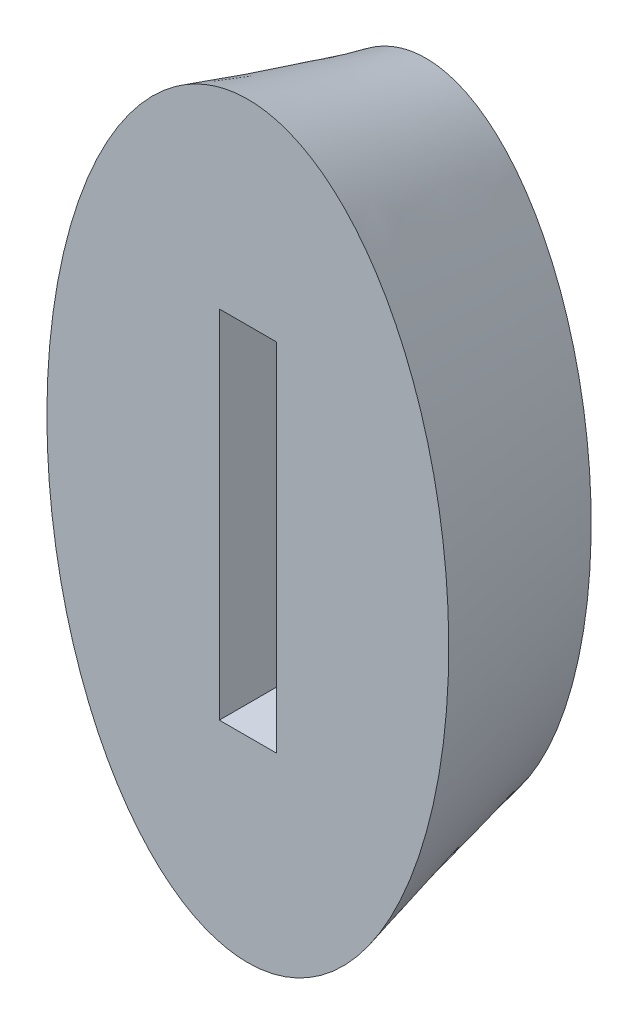
ISO-10303-21;
HEADER;
FILE_DESCRIPTION(('STEP AP214'),'2;1');
FILE_NAME('part.step','',(''),(''),'','','');
FILE_SCHEMA(('AUTOMOTIVE_DESIGN { 1 0 10303 214 1 1 1 1 }'));
ENDSEC;
DATA;
#1=APPLICATION_CONTEXT('core data for automotive mechanical design processes');
#2=APPLICATION_PROTOCOL_DEFINITION('international standard','automotive_design',2000,#1);
#3=PRODUCT_CONTEXT('',#1,'mechanical');
#4=PRODUCT('Part','Part','',(#3));
#5=PRODUCT_RELATED_PRODUCT_CATEGORY('part','',(#4));
#6=PRODUCT_DEFINITION_FORMATION('','',#4);
#7=PRODUCT_DEFINITION_CONTEXT('part definition',#1,'design');
#8=PRODUCT_DEFINITION('design','',#6,#7);
#9=PRODUCT_DEFINITION_SHAPE('','',#8);
#10=(LENGTH_UNIT() NAMED_UNIT(*) SI_UNIT(.MILLI.,.METRE.));
#11=(NAMED_UNIT(*) PLANE_ANGLE_UNIT() SI_UNIT($,.RADIAN.));
#12=(NAMED_UNIT(*) SI_UNIT($,.STERADIAN.) SOLID_ANGLE_UNIT());
#13=UNCERTAINTY_MEASURE_WITH_UNIT(LENGTH_MEASURE(1.E-05),#10,'distance_accuracy_value','');
#14=(GEOMETRIC_REPRESENTATION_CONTEXT(3) GLOBAL_UNCERTAINTY_ASSIGNED_CONTEXT((#13)) GLOBAL_UNIT_ASSIGNED_CONTEXT((#10,
#11,#12)) REPRESENTATION_CONTEXT('',''));
#15=CARTESIAN_POINT('',(0.,0.,0.));
#16=DIRECTION('',(0.,0.,1.));
#17=DIRECTION('',(1.,0.,0.));
#18=AXIS2_PLACEMENT_3D('',#15,#16,#17);
#19=CARTESIAN_POINT('',(0.,0.,-12.5));
#20=DIRECTION('',(0.,0.,1.));
#21=DIRECTION('',(1.,0.,0.));
#22=AXIS2_PLACEMENT_3D('',#19,#20,#21);
#23=PLANE('',#22);
#24=DIRECTION('',(1.,0.,0.));
#25=VECTOR('',#24,1.);
#26=CARTESIAN_POINT('',(0.,-12.5,-12.5));
#27=LINE('',#26,#25);
#28=CARTESIAN_POINT('',(-2.,-12.5,-12.5));
#29=VERTEX_POINT('',#28);
#30=CARTESIAN_POINT('',(2.,-12.5,-12.5));
#31=VERTEX_POINT('',#30);
#32=EDGE_CURVE('E263',#29,#31,#27,.T.);
#33=ORIENTED_EDGE('',*,*,#32,.T.);
#34=DIRECTION('',(0.,1.,0.));
#35=VECTOR('',#34,1.);
#36=CARTESIAN_POINT('',(2.,0.,-12.5));
#37=LINE('',#36,#35);
#38=CARTESIAN_POINT('',(2.,12.5,-12.5));
#39=VERTEX_POINT('',#38);
#40=EDGE_CURVE('E226',#31,#39,#37,.T.);
#41=ORIENTED_EDGE('',*,*,#40,.T.);
#42=DIRECTION('',(-1.,0.,0.));
#43=VECTOR('',#42,1.);
#44=CARTESIAN_POINT('',(0.,12.5,-12.5));
#45=LINE('',#44,#43);
#46=CARTESIAN_POINT('',(-2.,12.5,-12.5));
#47=VERTEX_POINT('',#46);
#48=EDGE_CURVE('E271',#39,#47,#45,.T.);
#49=ORIENTED_EDGE('',*,*,#48,.T.);
#50=DIRECTION('',(0.,-1.,0.));
#51=VECTOR('',#50,1.);
#52=CARTESIAN_POINT('',(-2.,0.,-12.5));
#53=LINE('',#52,#51);
#54=EDGE_CURVE('E267',#47,#29,#53,.T.);
#55=ORIENTED_EDGE('',*,*,#54,.T.);
#56=EDGE_LOOP('',(#33,#41,#49,#55));
#57=FACE_BOUND('',#56,.T.);
#58=DIRECTION('',(0.,1.,0.));
#59=VECTOR('',#58,1.);
#60=CARTESIAN_POINT('',(-4.00911681817695,15.0341819392631,-12.5));
#61=LINE('',#60,#59);
#62=CARTESIAN_POINT('',(-4.00911681817695,-15.0341819392631,-12.5));
#63=VERTEX_POINT('',#62);
#64=CARTESIAN_POINT('',(-4.00911681817695,15.0341819392631,-12.5));
#65=VERTEX_POINT('',#64);
#66=EDGE_CURVE('E160',#63,#65,#61,.T.);
#67=ORIENTED_EDGE('',*,*,#66,.T.);
#68=DIRECTION('',(1.,0.,0.));
#69=VECTOR('',#68,1.);
#70=CARTESIAN_POINT('',(4.00911681817695,15.0341819392631,-12.5));
#71=LINE('',#70,#69);
#72=CARTESIAN_POINT('',(4.00911681817695,15.0341819392631,-12.5));
#73=VERTEX_POINT('',#72);
#74=EDGE_CURVE('E127',#65,#73,#71,.T.);
#75=ORIENTED_EDGE('',*,*,#74,.T.);
#76=DIRECTION('',(0.,-1.,0.));
#77=VECTOR('',#76,1.);
#78=CARTESIAN_POINT('',(4.00911681817695,15.0341819392631,-12.5));
#79=LINE('',#78,#77);
#80=CARTESIAN_POINT('',(4.00911681817695,-15.0341819392631,-12.5));
#81=VERTEX_POINT('',#80);
#82=EDGE_CURVE('E71',#73,#81,#79,.T.);
#83=ORIENTED_EDGE('',*,*,#82,.T.);
#84=DIRECTION('',(-1.,0.,0.));
#85=VECTOR('',#84,1.);
#86=CARTESIAN_POINT('',(4.00911681817695,-15.0341819392631,-12.5));
#87=LINE('',#86,#85);
#88=EDGE_CURVE('E150',#81,#63,#87,.T.);
#89=ORIENTED_EDGE('',*,*,#88,.T.);
#90=EDGE_LOOP('',(#67,#75,#83,#89));
#91=FACE_BOUND('',#90,.T.);
#92=ADVANCED_FACE('F53',(#57,#91),#23,.F.);
#93=CARTESIAN_POINT('',(0.,0.,-12.5));
#94=DIRECTION('',(0.,0.,-1.));
#95=DIRECTION('',(0.,-1.,0.));
#96=AXIS2_PLACEMENT_3D('',#93,#94,#95);
#97=ELLIPSE('',#96,19.3105732119852,9.88915481816979);
#98=CARTESIAN_POINT('',(0.,-19.3105732119852,-12.5));
#99=VERTEX_POINT('',#98);
#100=EDGE_CURVE('E169',#99,#99,#97,.T.);
#101=ORIENTED_EDGE('',*,*,#100,.F.);
#102=EDGE_LOOP('',(#101));
#103=FACE_BOUND('',#102,.T.);
#104=CARTESIAN_POINT('',(0.,0.,-12.5));
#105=DIRECTION('',(0.,0.,1.));
#106=DIRECTION('',(0.,-1.,0.));
#107=AXIS2_PLACEMENT_3D('',#104,#105,#106);
#108=ELLIPSE('',#107,22.5,11.606);
#109=CARTESIAN_POINT('',(0.,-22.5,-12.5));
#110=VERTEX_POINT('',#109);
#111=EDGE_CURVE('E12',#110,#110,#108,.T.);
#112=ORIENTED_EDGE('',*,*,#111,.F.);
#113=EDGE_LOOP('',(#112));
#114=FACE_BOUND('',#113,.T.);
#115=ADVANCED_FACE('F55',(#103,#114),#23,.F.);
#116=CARTESIAN_POINT('',(0.,0.,0.));
#117=DIRECTION('',(0.,0.,1.));
#118=DIRECTION('',(1.,0.,0.));
#119=AXIS2_PLACEMENT_3D('',#116,#117,#118);
#120=PLANE('',#119);
#121=DIRECTION('',(0.,1.,0.));
#122=VECTOR('',#121,1.);
#123=CARTESIAN_POINT('',(2.,12.5,0.));
#124=LINE('',#123,#122);
#125=CARTESIAN_POINT('',(2.,-12.5,0.));
#126=VERTEX_POINT('',#125);
#127=CARTESIAN_POINT('',(2.,12.5,0.));
#128=VERTEX_POINT('',#127);
#129=EDGE_CURVE('E180',#126,#128,#124,.T.);
#130=ORIENTED_EDGE('',*,*,#129,.F.);
#131=DIRECTION('',(1.,0.,0.));
#132=VECTOR('',#131,1.);
#133=CARTESIAN_POINT('',(-2.,-12.5,0.));
#134=LINE('',#133,#132);
#135=CARTESIAN_POINT('',(-2.,-12.5,0.));
#136=VERTEX_POINT('',#135);
#137=EDGE_CURVE('E280',#136,#126,#134,.T.);
#138=ORIENTED_EDGE('',*,*,#137,.F.);
#139=DIRECTION('',(0.,-1.,0.));
#140=VECTOR('',#139,1.);
#141=CARTESIAN_POINT('',(-2.,12.5,0.));
#142=LINE('',#141,#140);
#143=CARTESIAN_POINT('',(-2.,12.5,0.));
#144=VERTEX_POINT('',#143);
#145=EDGE_CURVE('E291',#144,#136,#142,.T.);
#146=ORIENTED_EDGE('',*,*,#145,.F.);
#147=DIRECTION('',(-1.,0.,0.));
#148=VECTOR('',#147,1.);
#149=CARTESIAN_POINT('',(-2.,12.5,0.));
#150=LINE('',#149,#148);
#151=EDGE_CURVE('E295',#128,#144,#150,.T.);
#152=ORIENTED_EDGE('',*,*,#151,.F.);
#153=EDGE_LOOP('',(#130,#138,#146,#152));
#154=FACE_BOUND('',#153,.T.);
#155=CARTESIAN_POINT('',(0.,0.,0.));
#156=DIRECTION('',(0.,0.,1.));
#157=DIRECTION('',(0.,-1.,0.));
#158=AXIS2_PLACEMENT_3D('',#155,#156,#157);
#159=ELLIPSE('',#158,26.25,14.106);
#160=CARTESIAN_POINT('',(0.,-26.25,0.));
#161=VERTEX_POINT('',#160);
#162=EDGE_CURVE('E64',#161,#161,#159,.T.);
#163=ORIENTED_EDGE('',*,*,#162,.T.);
#164=EDGE_LOOP('',(#163));
#165=FACE_BOUND('',#164,.T.);
#166=ADVANCED_FACE('F205',(#154,#165),#120,.T.);
#167=CARTESIAN_POINT('',(13.179644062293,9.35581181622284,0.));
#168=CARTESIAN_POINT('',(9.96742864078532,11.5263610145073,-12.5));
#169=CARTESIAN_POINT('',(23.2347359845512,-39.6964576627493,0.));
#170=CARTESIAN_POINT('',(21.8585349460628,-27.120398319918,-12.5));
#171=CARTESIAN_POINT('',(-3.12455214003473,-58.408081295195,0.));
#172=CARTESIAN_POINT('',(1.92367766449215,-50.1731203489325,-12.5));
#173=CARTESIAN_POINT('',(-13.179644062293,-9.35581181622284,0.));
#174=CARTESIAN_POINT('',(-9.96742864078532,-11.5263610145073,-12.5));
#175=CARTESIAN_POINT('',(-23.2347359845512,39.6964576627493,0.));
#176=CARTESIAN_POINT('',(-21.8585349460628,27.1203983199179,-12.5));
#177=CARTESIAN_POINT('',(3.12455214003474,58.408081295195,0.));
#178=CARTESIAN_POINT('',(-1.92367766449216,50.1731203489325,-12.5));
#179=CARTESIAN_POINT('',(13.179644062293,9.35581181622284,0.));
#180=CARTESIAN_POINT('',(9.96742864078532,11.5263610145073,-12.5));
#181=(BOUNDED_SURFACE() B_SPLINE_SURFACE(3,1,((#167,#168),(#169,#170),(#171,#172),(#173,#174),
(#175,#176),(#177,#178),(#179,#180)),.UNSPECIFIED.,.T.,.F.,.F.) B_SPLINE_SURFACE_WITH_KNOTS((4,
3,4),(2,2),(0.,0.5,1.),(0.,1.),
.UNSPECIFIED.) GEOMETRIC_REPRESENTATION_ITEM() RATIONAL_B_SPLINE_SURFACE(((1.,1.),
(0.333333333333333,0.333333333333333),(0.333333333333333,0.333333333333333),(1.,1.),
(0.333333333333333,0.333333333333334),(0.333333333333333,0.333333333333334),(1.,1.))) REPRESENTATION_ITEM('') SURFACE());
#182=ORIENTED_EDGE('',*,*,#162,.F.);
#183=EDGE_LOOP('',(#182));
#184=FACE_BOUND('',#183,.T.);
#185=ORIENTED_EDGE('',*,*,#111,.T.);
#186=EDGE_LOOP('',(#185));
#187=FACE_BOUND('',#186,.T.);
#188=ADVANCED_FACE('F203',(#184,#187),#181,.T.);
#189=CARTESIAN_POINT('',(2.,12.5,-30.));
#190=DIRECTION('',(1.,0.,0.));
#191=DIRECTION('',(0.,1.,0.));
#192=AXIS2_PLACEMENT_3D('',#189,#190,#191);
#193=PLANE('',#192);
#194=DIRECTION('',(0.,0.,1.));
#195=VECTOR('',#194,1.);
#196=CARTESIAN_POINT('',(2.,-12.5,-30.));
#197=LINE('',#196,#195);
#198=EDGE_CURVE('E275',#31,#126,#197,.T.);
#199=ORIENTED_EDGE('',*,*,#198,.T.);
#200=ORIENTED_EDGE('',*,*,#129,.T.);
#201=DIRECTION('',(0.,0.,1.));
#202=VECTOR('',#201,1.);
#203=CARTESIAN_POINT('',(2.,12.5,-30.));
#204=LINE('',#203,#202);
#205=EDGE_CURVE('E276',#39,#128,#204,.T.);
#206=ORIENTED_EDGE('',*,*,#205,.F.);
#207=ORIENTED_EDGE('',*,*,#40,.F.);
#208=EDGE_LOOP('',(#199,#200,#206,#207));
#209=FACE_BOUND('',#208,.T.);
#210=ADVANCED_FACE('F194',(#209),#193,.F.);
#211=CARTESIAN_POINT('',(-2.,-12.5,-30.));
#212=DIRECTION('',(0.,-1.,0.));
#213=DIRECTION('',(0.,0.,-1.));
#214=AXIS2_PLACEMENT_3D('',#211,#212,#213);
#215=PLANE('',#214);
#216=DIRECTION('',(0.,0.,1.));
#217=VECTOR('',#216,1.);
#218=CARTESIAN_POINT('',(-2.,-12.5,-30.));
#219=LINE('',#218,#217);
#220=EDGE_CURVE('E283',#29,#136,#219,.T.);
#221=ORIENTED_EDGE('',*,*,#220,.T.);
#222=ORIENTED_EDGE('',*,*,#137,.T.);
#223=ORIENTED_EDGE('',*,*,#198,.F.);
#224=ORIENTED_EDGE('',*,*,#32,.F.);
#225=EDGE_LOOP('',(#221,#222,#223,#224));
#226=FACE_BOUND('',#225,.T.);
#227=ADVANCED_FACE('F190',(#226),#215,.F.);
#228=CARTESIAN_POINT('',(-2.,12.5,-30.));
#229=DIRECTION('',(-1.,0.,0.));
#230=DIRECTION('',(0.,-1.,0.));
#231=AXIS2_PLACEMENT_3D('',#228,#229,#230);
#232=PLANE('',#231);
#233=DIRECTION('',(0.,0.,1.));
#234=VECTOR('',#233,1.);
#235=CARTESIAN_POINT('',(-2.,12.5,-30.));
#236=LINE('',#235,#234);
#237=EDGE_CURVE('E79',#47,#144,#236,.T.);
#238=ORIENTED_EDGE('',*,*,#237,.T.);
#239=ORIENTED_EDGE('',*,*,#145,.T.);
#240=ORIENTED_EDGE('',*,*,#220,.F.);
#241=ORIENTED_EDGE('',*,*,#54,.F.);
#242=EDGE_LOOP('',(#238,#239,#240,#241));
#243=FACE_BOUND('',#242,.T.);
#244=ADVANCED_FACE('F193',(#243),#232,.F.);
#245=CARTESIAN_POINT('',(-2.,12.5,-30.));
#246=DIRECTION('',(0.,1.,0.));
#247=DIRECTION('',(0.,0.,1.));
#248=AXIS2_PLACEMENT_3D('',#245,#246,#247);
#249=PLANE('',#248);
#250=ORIENTED_EDGE('',*,*,#205,.T.);
#251=ORIENTED_EDGE('',*,*,#151,.T.);
#252=ORIENTED_EDGE('',*,*,#237,.F.);
#253=ORIENTED_EDGE('',*,*,#48,.F.);
#254=EDGE_LOOP('',(#250,#251,#252,#253));
#255=FACE_BOUND('',#254,.T.);
#256=ADVANCED_FACE('F187',(#255),#249,.F.);
#257=CARTESIAN_POINT('',(0.,0.,-5.));
#258=DIRECTION('',(0.,0.,-1.));
#259=DIRECTION('',(0.,-1.,0.));
#260=AXIS2_PLACEMENT_3D('',#257,#258,#259);
#261=ELLIPSE('',#260,19.3105732119852,9.88915481816979);
#262=DIRECTION('',(0.,0.,-1.));
#263=VECTOR('',#262,1.);
#264=SURFACE_OF_LINEAR_EXTRUSION('',#261,#263);
#265=CARTESIAN_POINT('',(0.,-19.3105732119852,-5.));
#266=VERTEX_POINT('',#265);
#267=EDGE_CURVE('E175',#266,#266,#261,.T.);
#268=ORIENTED_EDGE('',*,*,#267,.F.);
#269=EDGE_LOOP('',(#268));
#270=FACE_BOUND('',#269,.T.);
#271=ORIENTED_EDGE('',*,*,#100,.T.);
#272=EDGE_LOOP('',(#271));
#273=FACE_BOUND('',#272,.T.);
#274=ADVANCED_FACE('F183',(#270,#273),#264,.F.);
#275=CARTESIAN_POINT('',(0.,0.,-5.));
#276=DIRECTION('',(0.,0.,-1.));
#277=DIRECTION('',(-1.,0.,0.));
#278=AXIS2_PLACEMENT_3D('',#275,#276,#277);
#279=PLANE('',#278);
#280=DIRECTION('',(-1.,0.,0.));
#281=VECTOR('',#280,1.);
#282=CARTESIAN_POINT('',(4.00911681817695,-15.0341819392631,-5.));
#283=LINE('',#282,#281);
#284=CARTESIAN_POINT('',(4.00911681817695,-15.0341819392631,-5.));
#285=VERTEX_POINT('',#284);
#286=CARTESIAN_POINT('',(-4.00911681817695,-15.0341819392631,-5.));
#287=VERTEX_POINT('',#286);
#288=EDGE_CURVE('E134',#285,#287,#283,.T.);
#289=ORIENTED_EDGE('',*,*,#288,.F.);
#290=DIRECTION('',(0.,-1.,0.));
#291=VECTOR('',#290,1.);
#292=CARTESIAN_POINT('',(4.00911681817695,15.0341819392631,-5.));
#293=LINE('',#292,#291);
#294=CARTESIAN_POINT('',(4.00911681817695,15.0341819392631,-5.));
#295=VERTEX_POINT('',#294);
#296=EDGE_CURVE('E144',#295,#285,#293,.T.);
#297=ORIENTED_EDGE('',*,*,#296,.F.);
#298=DIRECTION('',(1.,0.,0.));
#299=VECTOR('',#298,1.);
#300=CARTESIAN_POINT('',(4.00911681817695,15.0341819392631,-5.));
#301=LINE('',#300,#299);
#302=CARTESIAN_POINT('',(-4.00911681817695,15.0341819392631,-5.));
#303=VERTEX_POINT('',#302);
#304=EDGE_CURVE('E125',#303,#295,#301,.T.);
#305=ORIENTED_EDGE('',*,*,#304,.F.);
#306=DIRECTION('',(0.,1.,0.));
#307=VECTOR('',#306,1.);
#308=CARTESIAN_POINT('',(-4.00911681817695,15.0341819392631,-5.));
#309=LINE('',#308,#307);
#310=EDGE_CURVE('E141',#287,#303,#309,.T.);
#311=ORIENTED_EDGE('',*,*,#310,.F.);
#312=EDGE_LOOP('',(#289,#297,#305,#311));
#313=FACE_BOUND('',#312,.T.);
#314=ORIENTED_EDGE('',*,*,#267,.T.);
#315=EDGE_LOOP('',(#314));
#316=FACE_BOUND('',#315,.T.);
#317=ADVANCED_FACE('F139',(#313,#316),#279,.T.);
#318=CARTESIAN_POINT('',(-4.00911681817695,15.0341819392631,-5.));
#319=DIRECTION('',(-1.,0.,0.));
#320=DIRECTION('',(0.,0.,1.));
#321=AXIS2_PLACEMENT_3D('',#318,#319,#320);
#322=PLANE('',#321);
#323=ORIENTED_EDGE('',*,*,#66,.F.);
#324=DIRECTION('',(0.,0.,-1.));
#325=VECTOR('',#324,1.);
#326=CARTESIAN_POINT('',(-4.00911681817695,-15.0341819392631,-5.));
#327=LINE('',#326,#325);
#328=EDGE_CURVE('E148',#287,#63,#327,.T.);
#329=ORIENTED_EDGE('',*,*,#328,.F.);
#330=ORIENTED_EDGE('',*,*,#310,.T.);
#331=DIRECTION('',(0.,0.,-1.));
#332=VECTOR('',#331,1.);
#333=CARTESIAN_POINT('',(-4.00911681817695,15.0341819392631,-5.));
#334=LINE('',#333,#332);
#335=EDGE_CURVE('E122',#303,#65,#334,.T.);
#336=ORIENTED_EDGE('',*,*,#335,.T.);
#337=EDGE_LOOP('',(#323,#329,#330,#336));
#338=FACE_BOUND('',#337,.T.);
#339=ADVANCED_FACE('F147',(#338),#322,.T.);
#340=CARTESIAN_POINT('',(4.00911681817695,-15.0341819392631,-5.));
#341=DIRECTION('',(0.,-1.,0.));
#342=DIRECTION('',(0.,0.,-1.));
#343=AXIS2_PLACEMENT_3D('',#340,#341,#342);
#344=PLANE('',#343);
#345=ORIENTED_EDGE('',*,*,#88,.F.);
#346=DIRECTION('',(0.,0.,-1.));
#347=VECTOR('',#346,1.);
#348=CARTESIAN_POINT('',(4.00911681817695,-15.0341819392631,-5.));
#349=LINE('',#348,#347);
#350=EDGE_CURVE('E170',#285,#81,#349,.T.);
#351=ORIENTED_EDGE('',*,*,#350,.F.);
#352=ORIENTED_EDGE('',*,*,#288,.T.);
#353=ORIENTED_EDGE('',*,*,#328,.T.);
#354=EDGE_LOOP('',(#345,#351,#352,#353));
#355=FACE_BOUND('',#354,.T.);
#356=ADVANCED_FACE('F311',(#355),#344,.T.);
#357=CARTESIAN_POINT('',(4.00911681817695,15.0341819392631,-5.));
#358=DIRECTION('',(1.,0.,0.));
#359=DIRECTION('',(0.,0.,-1.));
#360=AXIS2_PLACEMENT_3D('',#357,#358,#359);
#361=PLANE('',#360);
#362=ORIENTED_EDGE('',*,*,#82,.F.);
#363=DIRECTION('',(0.,0.,-1.));
#364=VECTOR('',#363,1.);
#365=CARTESIAN_POINT('',(4.00911681817695,15.0341819392631,-5.));
#366=LINE('',#365,#364);
#367=EDGE_CURVE('E133',#295,#73,#366,.T.);
#368=ORIENTED_EDGE('',*,*,#367,.F.);
#369=ORIENTED_EDGE('',*,*,#296,.T.);
#370=ORIENTED_EDGE('',*,*,#350,.T.);
#371=EDGE_LOOP('',(#362,#368,#369,#370));
#372=FACE_BOUND('',#371,.T.);
#373=ADVANCED_FACE('F312',(#372),#361,.T.);
#374=CARTESIAN_POINT('',(4.00911681817695,15.0341819392631,-5.));
#375=DIRECTION('',(0.,1.,0.));
#376=DIRECTION('',(0.,0.,1.));
#377=AXIS2_PLACEMENT_3D('',#374,#375,#376);
#378=PLANE('',#377);
#379=ORIENTED_EDGE('',*,*,#74,.F.);
#380=ORIENTED_EDGE('',*,*,#335,.F.);
#381=ORIENTED_EDGE('',*,*,#304,.T.);
#382=ORIENTED_EDGE('',*,*,#367,.T.);
#383=EDGE_LOOP('',(#379,#380,#381,#382));
#384=FACE_BOUND('',#383,.T.);
#385=ADVANCED_FACE('F124',(#384),#378,.T.);
#386=CLOSED_SHELL('',(#92,#115,#166,#188,#210,#227,#244,#256,#274,#317,#339,#356,#373,#385));
#387=MANIFOLD_SOLID_BREP('B2',#386);
#388=ADVANCED_BREP_SHAPE_REPRESENTATION('',(#18,#387),#14);
#389=SHAPE_DEFINITION_REPRESENTATION(#9,#388);
ENDSEC;
END-ISO-10303-21;
